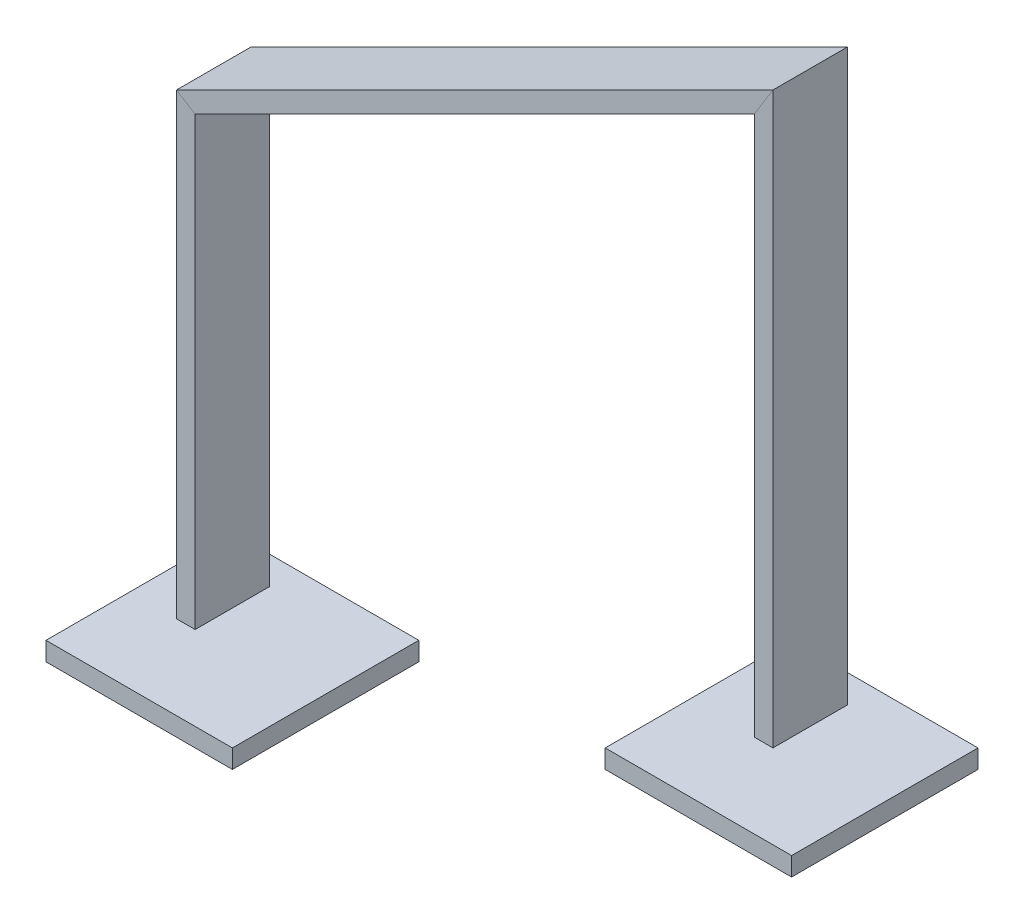
ISO-10303-21;
HEADER;
FILE_DESCRIPTION(('STEP AP214'),'2;1');
FILE_NAME('part.step','',(''),(''),'','','');
FILE_SCHEMA(('AUTOMOTIVE_DESIGN { 1 0 10303 214 1 1 1 1 }'));
ENDSEC;
DATA;
#1=APPLICATION_CONTEXT('core data for automotive mechanical design processes');
#2=APPLICATION_PROTOCOL_DEFINITION('international standard','automotive_design',2000,#1);
#3=PRODUCT_CONTEXT('',#1,'mechanical');
#4=PRODUCT('Part','Part','',(#3));
#5=PRODUCT_RELATED_PRODUCT_CATEGORY('part','',(#4));
#6=PRODUCT_DEFINITION_FORMATION('','',#4);
#7=PRODUCT_DEFINITION_CONTEXT('part definition',#1,'design');
#8=PRODUCT_DEFINITION('design','',#6,#7);
#9=PRODUCT_DEFINITION_SHAPE('','',#8);
#10=(LENGTH_UNIT() NAMED_UNIT(*) SI_UNIT(.MILLI.,.METRE.));
#11=(NAMED_UNIT(*) PLANE_ANGLE_UNIT() SI_UNIT($,.RADIAN.));
#12=(NAMED_UNIT(*) SI_UNIT($,.STERADIAN.) SOLID_ANGLE_UNIT());
#13=UNCERTAINTY_MEASURE_WITH_UNIT(LENGTH_MEASURE(1.E-05),#10,'distance_accuracy_value','');
#14=(GEOMETRIC_REPRESENTATION_CONTEXT(3) GLOBAL_UNCERTAINTY_ASSIGNED_CONTEXT((#13)) GLOBAL_UNIT_ASSIGNED_CONTEXT((#10,
#11,#12)) REPRESENTATION_CONTEXT('',''));
#15=CARTESIAN_POINT('',(0.,0.,0.));
#16=DIRECTION('',(0.,0.,1.));
#17=DIRECTION('',(1.,0.,0.));
#18=AXIS2_PLACEMENT_3D('',#15,#16,#17);
#19=CARTESIAN_POINT('',(400.,125.,0.));
#20=DIRECTION('',(0.,-1.,0.));
#21=DIRECTION('',(0.,0.,1.));
#22=AXIS2_PLACEMENT_3D('',#19,#20,#21);
#23=PLANE('',#22);
#24=DIRECTION('',(0.,0.,-1.));
#25=VECTOR('',#24,1.);
#26=CARTESIAN_POINT('',(350.,125.,0.));
#27=LINE('',#26,#25);
#28=CARTESIAN_POINT('',(350.,125.,20.));
#29=VERTEX_POINT('',#28);
#30=CARTESIAN_POINT('',(350.,125.,-20.));
#31=VERTEX_POINT('',#30);
#32=EDGE_CURVE('E196',#29,#31,#27,.T.);
#33=ORIENTED_EDGE('',*,*,#32,.T.);
#34=DIRECTION('',(1.,0.,0.));
#35=VECTOR('',#34,1.);
#36=CARTESIAN_POINT('',(400.,125.,-20.));
#37=LINE('',#36,#35);
#38=CARTESIAN_POINT('',(360.,125.,-20.));
#39=VERTEX_POINT('',#38);
#40=EDGE_CURVE('E209',#31,#39,#37,.T.);
#41=ORIENTED_EDGE('',*,*,#40,.T.);
#42=DIRECTION('',(0.,0.,1.));
#43=VECTOR('',#42,1.);
#44=CARTESIAN_POINT('',(360.,125.,0.));
#45=LINE('',#44,#43);
#46=CARTESIAN_POINT('',(360.,125.,20.));
#47=VERTEX_POINT('',#46);
#48=EDGE_CURVE('E213',#39,#47,#45,.T.);
#49=ORIENTED_EDGE('',*,*,#48,.T.);
#50=DIRECTION('',(-1.,0.,0.));
#51=VECTOR('',#50,1.);
#52=CARTESIAN_POINT('',(400.,125.,20.));
#53=LINE('',#52,#51);
#54=EDGE_CURVE('E210',#47,#29,#53,.T.);
#55=ORIENTED_EDGE('',*,*,#54,.T.);
#56=EDGE_LOOP('',(#33,#41,#49,#55));
#57=FACE_BOUND('',#56,.T.);
#58=ADVANCED_FACE('F53',(#57),#23,.T.);
#59=CARTESIAN_POINT('',(0.,25.,0.));
#60=DIRECTION('',(0.,1.,0.));
#61=DIRECTION('',(0.,0.,1.));
#62=AXIS2_PLACEMENT_3D('',#59,#60,#61);
#63=PLANE('',#62);
#64=DIRECTION('',(0.,0.,-1.));
#65=VECTOR('',#64,1.);
#66=CARTESIAN_POINT('',(50.,25.,0.));
#67=LINE('',#66,#65);
#68=CARTESIAN_POINT('',(50.,25.,20.));
#69=VERTEX_POINT('',#68);
#70=CARTESIAN_POINT('',(50.,25.,-20.));
#71=VERTEX_POINT('',#70);
#72=EDGE_CURVE('E173',#69,#71,#67,.T.);
#73=ORIENTED_EDGE('',*,*,#72,.F.);
#74=DIRECTION('',(1.,0.,0.));
#75=VECTOR('',#74,1.);
#76=CARTESIAN_POINT('',(0.,25.,20.));
#77=LINE('',#76,#75);
#78=CARTESIAN_POINT('',(40.,25.,20.));
#79=VERTEX_POINT('',#78);
#80=EDGE_CURVE('E57',#79,#69,#77,.T.);
#81=ORIENTED_EDGE('',*,*,#80,.F.);
#82=DIRECTION('',(0.,0.,1.));
#83=VECTOR('',#82,1.);
#84=CARTESIAN_POINT('',(40.,25.,0.));
#85=LINE('',#84,#83);
#86=CARTESIAN_POINT('',(40.,25.,-20.));
#87=VERTEX_POINT('',#86);
#88=EDGE_CURVE('E162',#87,#79,#85,.T.);
#89=ORIENTED_EDGE('',*,*,#88,.F.);
#90=DIRECTION('',(-1.,0.,0.));
#91=VECTOR('',#90,1.);
#92=CARTESIAN_POINT('',(0.,25.,-20.));
#93=LINE('',#92,#91);
#94=EDGE_CURVE('E220',#71,#87,#93,.T.);
#95=ORIENTED_EDGE('',*,*,#94,.F.);
#96=EDGE_LOOP('',(#73,#81,#89,#95));
#97=FACE_BOUND('',#96,.T.);
#98=ADVANCED_FACE('F55',(#97),#63,.F.);
#99=CARTESIAN_POINT('',(350.,432.406871063723,20.));
#100=DIRECTION('',(-1.,0.,0.));
#101=DIRECTION('',(0.,0.,1.));
#102=AXIS2_PLACEMENT_3D('',#99,#100,#101);
#103=PLANE('',#102);
#104=DIRECTION('',(0.,0.,1.));
#105=VECTOR('',#104,1.);
#106=CARTESIAN_POINT('',(350.,414.508497187474,20.0000000000001));
#107=LINE('',#106,#105);
#108=CARTESIAN_POINT('',(350.,414.508497187474,-20.));
#109=VERTEX_POINT('',#108);
#110=CARTESIAN_POINT('',(350.,414.508497187474,20.));
#111=VERTEX_POINT('',#110);
#112=EDGE_CURVE('E140',#109,#111,#107,.T.);
#113=ORIENTED_EDGE('',*,*,#112,.F.);
#114=DIRECTION('',(0.,-1.,0.));
#115=VECTOR('',#114,1.);
#116=CARTESIAN_POINT('',(350.,432.406871063723,-20.));
#117=LINE('',#116,#115);
#118=EDGE_CURVE('E200',#109,#31,#117,.T.);
#119=ORIENTED_EDGE('',*,*,#118,.T.);
#120=ORIENTED_EDGE('',*,*,#32,.F.);
#121=DIRECTION('',(0.,-1.,0.));
#122=VECTOR('',#121,1.);
#123=CARTESIAN_POINT('',(350.,432.406871063723,20.));
#124=LINE('',#123,#122);
#125=EDGE_CURVE('E184',#111,#29,#124,.T.);
#126=ORIENTED_EDGE('',*,*,#125,.F.);
#127=EDGE_LOOP('',(#113,#119,#120,#126));
#128=FACE_BOUND('',#127,.T.);
#129=ADVANCED_FACE('F253',(#128),#103,.T.);
#130=CARTESIAN_POINT('',(350.,432.406871063723,-20.));
#131=DIRECTION('',(0.,0.,-1.));
#132=DIRECTION('',(-1.,0.,0.));
#133=AXIS2_PLACEMENT_3D('',#130,#131,#132);
#134=PLANE('',#133);
#135=DIRECTION('',(-0.525731112119134,-0.85065080835204,0.));
#136=VECTOR('',#135,1.);
#137=CARTESIAN_POINT('',(196.9149534157,166.811688644715,-19.9999999999998));
#138=LINE('',#137,#136);
#139=CARTESIAN_POINT('',(360.,430.688837074973,-20.));
#140=VERTEX_POINT('',#139);
#141=EDGE_CURVE('E169',#140,#109,#138,.T.);
#142=ORIENTED_EDGE('',*,*,#141,.F.);
#143=DIRECTION('',(0.,-1.,0.));
#144=VECTOR('',#143,1.);
#145=CARTESIAN_POINT('',(360.,432.406871063723,-20.));
#146=LINE('',#145,#144);
#147=EDGE_CURVE('E195',#140,#39,#146,.T.);
#148=ORIENTED_EDGE('',*,*,#147,.T.);
#149=ORIENTED_EDGE('',*,*,#40,.F.);
#150=ORIENTED_EDGE('',*,*,#118,.F.);
#151=EDGE_LOOP('',(#142,#148,#149,#150));
#152=FACE_BOUND('',#151,.T.);
#153=ADVANCED_FACE('F256',(#152),#134,.T.);
#154=CARTESIAN_POINT('',(360.,432.406871063723,20.));
#155=DIRECTION('',(1.,0.,0.));
#156=DIRECTION('',(0.,0.,-1.));
#157=AXIS2_PLACEMENT_3D('',#154,#155,#156);
#158=PLANE('',#157);
#159=DIRECTION('',(0.,0.,-1.));
#160=VECTOR('',#159,1.);
#161=CARTESIAN_POINT('',(360.,430.688837074973,20.0000000000001));
#162=LINE('',#161,#160);
#163=CARTESIAN_POINT('',(360.,430.688837074973,20.));
#164=VERTEX_POINT('',#163);
#165=EDGE_CURVE('E174',#164,#140,#162,.T.);
#166=ORIENTED_EDGE('',*,*,#165,.F.);
#167=DIRECTION('',(0.,-1.,0.));
#168=VECTOR('',#167,1.);
#169=CARTESIAN_POINT('',(360.,432.406871063723,20.));
#170=LINE('',#169,#168);
#171=EDGE_CURVE('E191',#164,#47,#170,.T.);
#172=ORIENTED_EDGE('',*,*,#171,.T.);
#173=ORIENTED_EDGE('',*,*,#48,.F.);
#174=ORIENTED_EDGE('',*,*,#147,.F.);
#175=EDGE_LOOP('',(#166,#172,#173,#174));
#176=FACE_BOUND('',#175,.T.);
#177=ADVANCED_FACE('F260',(#176),#158,.T.);
#178=CARTESIAN_POINT('',(350.,432.406871063723,20.));
#179=DIRECTION('',(0.,0.,1.));
#180=DIRECTION('',(1.,0.,0.));
#181=AXIS2_PLACEMENT_3D('',#178,#179,#180);
#182=PLANE('',#181);
#183=DIRECTION('',(0.525731112119134,0.85065080835204,0.));
#184=VECTOR('',#183,1.);
#185=CARTESIAN_POINT('',(196.9149534157,166.811688644715,19.9999999999999));
#186=LINE('',#185,#184);
#187=EDGE_CURVE('E178',#111,#164,#186,.T.);
#188=ORIENTED_EDGE('',*,*,#187,.F.);
#189=ORIENTED_EDGE('',*,*,#125,.T.);
#190=ORIENTED_EDGE('',*,*,#54,.F.);
#191=ORIENTED_EDGE('',*,*,#171,.F.);
#192=EDGE_LOOP('',(#188,#189,#190,#191));
#193=FACE_BOUND('',#192,.T.);
#194=ADVANCED_FACE('F252',(#193),#182,.T.);
#195=CARTESIAN_POINT('',(43.8299068313995,261.423450603173,20.));
#196=DIRECTION('',(0.,0.,1.));
#197=DIRECTION('',(0.,-1.,0.));
#198=AXIS2_PLACEMENT_3D('',#195,#196,#197);
#199=PLANE('',#198);
#200=DIRECTION('',(0.894427190999916,0.447213595499958,0.));
#201=VECTOR('',#200,1.);
#202=CARTESIAN_POINT('',(43.8299068313995,261.423450603173,20.));
#203=LINE('',#202,#201);
#204=CARTESIAN_POINT('',(50.,264.508497187474,20.));
#205=VERTEX_POINT('',#204);
#206=EDGE_CURVE('E129',#205,#111,#203,.T.);
#207=ORIENTED_EDGE('',*,*,#206,.T.);
#208=ORIENTED_EDGE('',*,*,#187,.T.);
#209=DIRECTION('',(0.894427190999916,0.447213595499958,0.));
#210=VECTOR('',#209,1.);
#211=CARTESIAN_POINT('',(39.3577708763999,270.367722513173,20.));
#212=LINE('',#211,#210);
#213=CARTESIAN_POINT('',(40.,270.688837074973,20.));
#214=VERTEX_POINT('',#213);
#215=EDGE_CURVE('E131',#214,#164,#212,.T.);
#216=ORIENTED_EDGE('',*,*,#215,.F.);
#217=DIRECTION('',(-0.85065080835204,0.525731112119134,0.));
#218=VECTOR('',#217,1.);
#219=CARTESIAN_POINT('',(163.819660112501,194.164078649987,20.));
#220=LINE('',#219,#218);
#221=EDGE_CURVE('E126',#205,#214,#220,.T.);
#222=ORIENTED_EDGE('',*,*,#221,.F.);
#223=EDGE_LOOP('',(#207,#208,#216,#222));
#224=FACE_BOUND('',#223,.T.);
#225=ADVANCED_FACE('F127',(#224),#199,.T.);
#226=CARTESIAN_POINT('',(39.3577708763999,270.367722513173,20.));
#227=DIRECTION('',(-0.447213595499958,0.894427190999916,0.));
#228=DIRECTION('',(-0.894427190999916,-0.447213595499958,0.));
#229=AXIS2_PLACEMENT_3D('',#226,#227,#228);
#230=PLANE('',#229);
#231=ORIENTED_EDGE('',*,*,#215,.T.);
#232=ORIENTED_EDGE('',*,*,#165,.T.);
#233=DIRECTION('',(0.894427190999916,0.447213595499958,0.));
#234=VECTOR('',#233,1.);
#235=CARTESIAN_POINT('',(39.3577708763999,270.367722513173,-20.));
#236=LINE('',#235,#234);
#237=CARTESIAN_POINT('',(40.,270.688837074973,-20.));
#238=VERTEX_POINT('',#237);
#239=EDGE_CURVE('E183',#238,#140,#236,.T.);
#240=ORIENTED_EDGE('',*,*,#239,.F.);
#241=DIRECTION('',(0.,0.,-1.));
#242=VECTOR('',#241,1.);
#243=CARTESIAN_POINT('',(40.,270.688837074973,20.));
#244=LINE('',#243,#242);
#245=EDGE_CURVE('E64',#214,#238,#244,.T.);
#246=ORIENTED_EDGE('',*,*,#245,.F.);
#247=EDGE_LOOP('',(#231,#232,#240,#246));
#248=FACE_BOUND('',#247,.T.);
#249=ADVANCED_FACE('F246',(#248),#230,.T.);
#250=CARTESIAN_POINT('',(43.8299068313995,261.423450603173,-20.));
#251=DIRECTION('',(0.,0.,-1.));
#252=DIRECTION('',(0.,1.,0.));
#253=AXIS2_PLACEMENT_3D('',#250,#251,#252);
#254=PLANE('',#253);
#255=ORIENTED_EDGE('',*,*,#239,.T.);
#256=ORIENTED_EDGE('',*,*,#141,.T.);
#257=DIRECTION('',(0.894427190999916,0.447213595499958,0.));
#258=VECTOR('',#257,1.);
#259=CARTESIAN_POINT('',(43.8299068313995,261.423450603173,-20.));
#260=LINE('',#259,#258);
#261=CARTESIAN_POINT('',(50.,264.508497187474,-20.));
#262=VERTEX_POINT('',#261);
#263=EDGE_CURVE('E142',#262,#109,#260,.T.);
#264=ORIENTED_EDGE('',*,*,#263,.F.);
#265=DIRECTION('',(0.85065080835204,-0.525731112119134,0.));
#266=VECTOR('',#265,1.);
#267=CARTESIAN_POINT('',(163.819660112501,194.164078649987,-19.9999999999999));
#268=LINE('',#267,#266);
#269=EDGE_CURVE('E13',#238,#262,#268,.T.);
#270=ORIENTED_EDGE('',*,*,#269,.F.);
#271=EDGE_LOOP('',(#255,#256,#264,#270));
#272=FACE_BOUND('',#271,.T.);
#273=ADVANCED_FACE('F243',(#272),#254,.T.);
#274=CARTESIAN_POINT('',(43.8299068313995,261.423450603173,20.));
#275=DIRECTION('',(0.447213595499958,-0.894427190999916,0.));
#276=DIRECTION('',(0.894427190999916,0.447213595499958,0.));
#277=AXIS2_PLACEMENT_3D('',#274,#275,#276);
#278=PLANE('',#277);
#279=ORIENTED_EDGE('',*,*,#263,.T.);
#280=ORIENTED_EDGE('',*,*,#112,.T.);
#281=ORIENTED_EDGE('',*,*,#206,.F.);
#282=DIRECTION('',(0.,0.,1.));
#283=VECTOR('',#282,1.);
#284=CARTESIAN_POINT('',(50.,264.508497187474,20.));
#285=LINE('',#284,#283);
#286=EDGE_CURVE('E120',#262,#205,#285,.T.);
#287=ORIENTED_EDGE('',*,*,#286,.F.);
#288=EDGE_LOOP('',(#279,#280,#281,#287));
#289=FACE_BOUND('',#288,.T.);
#290=ADVANCED_FACE('F139',(#289),#278,.T.);
#291=CARTESIAN_POINT('',(50.,10.,20.));
#292=DIRECTION('',(0.,0.,1.));
#293=DIRECTION('',(1.,0.,0.));
#294=AXIS2_PLACEMENT_3D('',#291,#292,#293);
#295=PLANE('',#294);
#296=DIRECTION('',(0.,1.,0.));
#297=VECTOR('',#296,1.);
#298=CARTESIAN_POINT('',(50.,10.,20.));
#299=LINE('',#298,#297);
#300=EDGE_CURVE('E149',#69,#205,#299,.T.);
#301=ORIENTED_EDGE('',*,*,#300,.T.);
#302=ORIENTED_EDGE('',*,*,#221,.T.);
#303=DIRECTION('',(0.,1.,0.));
#304=VECTOR('',#303,1.);
#305=CARTESIAN_POINT('',(40.,10.,20.));
#306=LINE('',#305,#304);
#307=EDGE_CURVE('E153',#79,#214,#306,.T.);
#308=ORIENTED_EDGE('',*,*,#307,.F.);
#309=ORIENTED_EDGE('',*,*,#80,.T.);
#310=EDGE_LOOP('',(#301,#302,#308,#309));
#311=FACE_BOUND('',#310,.T.);
#312=ADVANCED_FACE('F155',(#311),#295,.T.);
#313=CARTESIAN_POINT('',(40.,10.,20.));
#314=DIRECTION('',(-1.,0.,0.));
#315=DIRECTION('',(0.,0.,1.));
#316=AXIS2_PLACEMENT_3D('',#313,#314,#315);
#317=PLANE('',#316);
#318=ORIENTED_EDGE('',*,*,#307,.T.);
#319=ORIENTED_EDGE('',*,*,#245,.T.);
#320=DIRECTION('',(0.,1.,0.));
#321=VECTOR('',#320,1.);
#322=CARTESIAN_POINT('',(40.,10.,-20.));
#323=LINE('',#322,#321);
#324=EDGE_CURVE('E160',#87,#238,#323,.T.);
#325=ORIENTED_EDGE('',*,*,#324,.F.);
#326=ORIENTED_EDGE('',*,*,#88,.T.);
#327=EDGE_LOOP('',(#318,#319,#325,#326));
#328=FACE_BOUND('',#327,.T.);
#329=ADVANCED_FACE('F226',(#328),#317,.T.);
#330=CARTESIAN_POINT('',(50.,10.,-20.));
#331=DIRECTION('',(0.,0.,-1.));
#332=DIRECTION('',(-1.,0.,0.));
#333=AXIS2_PLACEMENT_3D('',#330,#331,#332);
#334=PLANE('',#333);
#335=ORIENTED_EDGE('',*,*,#324,.T.);
#336=ORIENTED_EDGE('',*,*,#269,.T.);
#337=DIRECTION('',(0.,1.,0.));
#338=VECTOR('',#337,1.);
#339=CARTESIAN_POINT('',(50.,10.,-20.));
#340=LINE('',#339,#338);
#341=EDGE_CURVE('E151',#71,#262,#340,.T.);
#342=ORIENTED_EDGE('',*,*,#341,.F.);
#343=ORIENTED_EDGE('',*,*,#94,.T.);
#344=EDGE_LOOP('',(#335,#336,#342,#343));
#345=FACE_BOUND('',#344,.T.);
#346=ADVANCED_FACE('F229',(#345),#334,.T.);
#347=CARTESIAN_POINT('',(50.,10.,20.));
#348=DIRECTION('',(1.,0.,0.));
#349=DIRECTION('',(0.,0.,-1.));
#350=AXIS2_PLACEMENT_3D('',#347,#348,#349);
#351=PLANE('',#350);
#352=ORIENTED_EDGE('',*,*,#341,.T.);
#353=ORIENTED_EDGE('',*,*,#286,.T.);
#354=ORIENTED_EDGE('',*,*,#300,.F.);
#355=ORIENTED_EDGE('',*,*,#72,.T.);
#356=EDGE_LOOP('',(#352,#353,#354,#355));
#357=FACE_BOUND('',#356,.T.);
#358=ADVANCED_FACE('F147',(#357),#351,.T.);
#359=CLOSED_SHELL('',(#58,#98,#129,#153,#177,#194,#225,#249,#273,#290,#312,#329,#346,#358));
#360=MANIFOLD_SOLID_BREP('B2',#359);
#361=CARTESIAN_POINT('',(300.,100.,50.));
#362=DIRECTION('',(1.,0.,0.));
#363=DIRECTION('',(0.,0.,-1.));
#364=AXIS2_PLACEMENT_3D('',#361,#362,#363);
#365=PLANE('',#364);
#366=DIRECTION('',(0.,-1.,0.));
#367=VECTOR('',#366,1.);
#368=CARTESIAN_POINT('',(300.,100.,-50.));
#369=LINE('',#368,#367);
#370=CARTESIAN_POINT('',(300.,110.,-50.));
#371=VERTEX_POINT('',#370);
#372=CARTESIAN_POINT('',(300.,100.,-50.));
#373=VERTEX_POINT('',#372);
#374=EDGE_CURVE('E436',#371,#373,#369,.T.);
#375=ORIENTED_EDGE('',*,*,#374,.T.);
#376=DIRECTION('',(0.,0.,-1.));
#377=VECTOR('',#376,1.);
#378=CARTESIAN_POINT('',(300.,100.,50.));
#379=LINE('',#378,#377);
#380=CARTESIAN_POINT('',(300.,100.,50.));
#381=VERTEX_POINT('',#380);
#382=EDGE_CURVE('E51',#381,#373,#379,.T.);
#383=ORIENTED_EDGE('',*,*,#382,.F.);
#384=DIRECTION('',(0.,-1.,0.));
#385=VECTOR('',#384,1.);
#386=CARTESIAN_POINT('',(300.,100.,50.));
#387=LINE('',#386,#385);
#388=CARTESIAN_POINT('',(300.,110.,50.));
#389=VERTEX_POINT('',#388);
#390=EDGE_CURVE('E424',#389,#381,#387,.T.);
#391=ORIENTED_EDGE('',*,*,#390,.F.);
#392=DIRECTION('',(0.,0.,-1.));
#393=VECTOR('',#392,1.);
#394=CARTESIAN_POINT('',(300.,110.,50.));
#395=LINE('',#394,#393);
#396=EDGE_CURVE('E432',#389,#371,#395,.T.);
#397=ORIENTED_EDGE('',*,*,#396,.T.);
#398=EDGE_LOOP('',(#375,#383,#391,#397));
#399=FACE_BOUND('',#398,.T.);
#400=ADVANCED_FACE('F373',(#399),#365,.F.);
#401=CARTESIAN_POINT('',(300.,100.,50.));
#402=DIRECTION('',(0.,1.,0.));
#403=DIRECTION('',(0.,0.,1.));
#404=AXIS2_PLACEMENT_3D('',#401,#402,#403);
#405=PLANE('',#404);
#406=DIRECTION('',(1.,0.,0.));
#407=VECTOR('',#406,1.);
#408=CARTESIAN_POINT('',(300.,100.,-50.));
#409=LINE('',#408,#407);
#410=CARTESIAN_POINT('',(400.,100.,-50.));
#411=VERTEX_POINT('',#410);
#412=EDGE_CURVE('E428',#373,#411,#409,.T.);
#413=ORIENTED_EDGE('',*,*,#412,.T.);
#414=DIRECTION('',(0.,0.,-1.));
#415=VECTOR('',#414,1.);
#416=CARTESIAN_POINT('',(400.,100.,50.));
#417=LINE('',#416,#415);
#418=CARTESIAN_POINT('',(400.,100.,50.));
#419=VERTEX_POINT('',#418);
#420=EDGE_CURVE('E381',#419,#411,#417,.T.);
#421=ORIENTED_EDGE('',*,*,#420,.F.);
#422=DIRECTION('',(1.,0.,0.));
#423=VECTOR('',#422,1.);
#424=CARTESIAN_POINT('',(300.,100.,50.));
#425=LINE('',#424,#423);
#426=EDGE_CURVE('E419',#381,#419,#425,.T.);
#427=ORIENTED_EDGE('',*,*,#426,.F.);
#428=ORIENTED_EDGE('',*,*,#382,.T.);
#429=EDGE_LOOP('',(#413,#421,#427,#428));
#430=FACE_BOUND('',#429,.T.);
#431=ADVANCED_FACE('F427',(#430),#405,.F.);
#432=CARTESIAN_POINT('',(400.,100.,50.));
#433=DIRECTION('',(-1.,0.,0.));
#434=DIRECTION('',(0.,0.,1.));
#435=AXIS2_PLACEMENT_3D('',#432,#433,#434);
#436=PLANE('',#435);
#437=DIRECTION('',(0.,1.,0.));
#438=VECTOR('',#437,1.);
#439=CARTESIAN_POINT('',(400.,100.,-50.));
#440=LINE('',#439,#438);
#441=CARTESIAN_POINT('',(400.,110.,-50.));
#442=VERTEX_POINT('',#441);
#443=EDGE_CURVE('E406',#411,#442,#440,.T.);
#444=ORIENTED_EDGE('',*,*,#443,.T.);
#445=DIRECTION('',(0.,0.,-1.));
#446=VECTOR('',#445,1.);
#447=CARTESIAN_POINT('',(400.,110.,50.));
#448=LINE('',#447,#446);
#449=CARTESIAN_POINT('',(400.,110.,50.));
#450=VERTEX_POINT('',#449);
#451=EDGE_CURVE('E429',#450,#442,#448,.T.);
#452=ORIENTED_EDGE('',*,*,#451,.F.);
#453=DIRECTION('',(0.,1.,0.));
#454=VECTOR('',#453,1.);
#455=CARTESIAN_POINT('',(400.,100.,50.));
#456=LINE('',#455,#454);
#457=EDGE_CURVE('E422',#419,#450,#456,.T.);
#458=ORIENTED_EDGE('',*,*,#457,.F.);
#459=ORIENTED_EDGE('',*,*,#420,.T.);
#460=EDGE_LOOP('',(#444,#452,#458,#459));
#461=FACE_BOUND('',#460,.T.);
#462=ADVANCED_FACE('F430',(#461),#436,.F.);
#463=CARTESIAN_POINT('',(300.,110.,50.));
#464=DIRECTION('',(0.,-1.,0.));
#465=DIRECTION('',(0.,0.,-1.));
#466=AXIS2_PLACEMENT_3D('',#463,#464,#465);
#467=PLANE('',#466);
#468=DIRECTION('',(-1.,0.,0.));
#469=VECTOR('',#468,1.);
#470=CARTESIAN_POINT('',(300.,110.,-50.));
#471=LINE('',#470,#469);
#472=EDGE_CURVE('E412',#442,#371,#471,.T.);
#473=ORIENTED_EDGE('',*,*,#472,.T.);
#474=ORIENTED_EDGE('',*,*,#396,.F.);
#475=DIRECTION('',(-1.,0.,0.));
#476=VECTOR('',#475,1.);
#477=CARTESIAN_POINT('',(300.,110.,50.));
#478=LINE('',#477,#476);
#479=EDGE_CURVE('E389',#450,#389,#478,.T.);
#480=ORIENTED_EDGE('',*,*,#479,.F.);
#481=ORIENTED_EDGE('',*,*,#451,.T.);
#482=EDGE_LOOP('',(#473,#474,#480,#481));
#483=FACE_BOUND('',#482,.T.);
#484=ADVANCED_FACE('F443',(#483),#467,.F.);
#485=CARTESIAN_POINT('',(0.,0.,50.));
#486=DIRECTION('',(0.,0.,-1.));
#487=DIRECTION('',(-1.,0.,0.));
#488=AXIS2_PLACEMENT_3D('',#485,#486,#487);
#489=PLANE('',#488);
#490=ORIENTED_EDGE('',*,*,#390,.T.);
#491=ORIENTED_EDGE('',*,*,#426,.T.);
#492=ORIENTED_EDGE('',*,*,#457,.T.);
#493=ORIENTED_EDGE('',*,*,#479,.T.);
#494=EDGE_LOOP('',(#490,#491,#492,#493));
#495=FACE_BOUND('',#494,.T.);
#496=ADVANCED_FACE('F420',(#495),#489,.F.);
#497=CARTESIAN_POINT('',(0.,0.,-50.));
#498=DIRECTION('',(0.,0.,-1.));
#499=DIRECTION('',(-1.,0.,0.));
#500=AXIS2_PLACEMENT_3D('',#497,#498,#499);
#501=PLANE('',#500);
#502=ORIENTED_EDGE('',*,*,#374,.F.);
#503=ORIENTED_EDGE('',*,*,#472,.F.);
#504=ORIENTED_EDGE('',*,*,#443,.F.);
#505=ORIENTED_EDGE('',*,*,#412,.F.);
#506=EDGE_LOOP('',(#502,#503,#504,#505));
#507=FACE_BOUND('',#506,.T.);
#508=ADVANCED_FACE('F446',(#507),#501,.T.);
#509=CLOSED_SHELL('',(#400,#431,#462,#484,#496,#508));
#510=MANIFOLD_SOLID_BREP('B7',#509);
#511=CARTESIAN_POINT('',(0.,10.,50.));
#512=DIRECTION('',(1.,0.,0.));
#513=DIRECTION('',(0.,0.,-1.));
#514=AXIS2_PLACEMENT_3D('',#511,#512,#513);
#515=PLANE('',#514);
#516=DIRECTION('',(0.,0.,1.));
#517=VECTOR('',#516,1.);
#518=CARTESIAN_POINT('',(0.,0.,50.));
#519=LINE('',#518,#517);
#520=CARTESIAN_POINT('',(0.,0.,-50.));
#521=VERTEX_POINT('',#520);
#522=CARTESIAN_POINT('',(0.,0.,50.));
#523=VERTEX_POINT('',#522);
#524=EDGE_CURVE('E559',#521,#523,#519,.T.);
#525=ORIENTED_EDGE('',*,*,#524,.T.);
#526=DIRECTION('',(0.,-1.,0.));
#527=VECTOR('',#526,1.);
#528=CARTESIAN_POINT('',(0.,10.,50.));
#529=LINE('',#528,#527);
#530=CARTESIAN_POINT('',(0.,10.,50.));
#531=VERTEX_POINT('',#530);
#532=EDGE_CURVE('E371',#531,#523,#529,.T.);
#533=ORIENTED_EDGE('',*,*,#532,.F.);
#534=DIRECTION('',(0.,0.,1.));
#535=VECTOR('',#534,1.);
#536=CARTESIAN_POINT('',(0.,10.,50.));
#537=LINE('',#536,#535);
#538=CARTESIAN_POINT('',(0.,10.,-50.));
#539=VERTEX_POINT('',#538);
#540=EDGE_CURVE('E547',#539,#531,#537,.T.);
#541=ORIENTED_EDGE('',*,*,#540,.F.);
#542=DIRECTION('',(0.,-1.,0.));
#543=VECTOR('',#542,1.);
#544=CARTESIAN_POINT('',(0.,10.,-50.));
#545=LINE('',#544,#543);
#546=EDGE_CURVE('E555',#539,#521,#545,.T.);
#547=ORIENTED_EDGE('',*,*,#546,.T.);
#548=EDGE_LOOP('',(#525,#533,#541,#547));
#549=FACE_BOUND('',#548,.T.);
#550=ADVANCED_FACE('F496',(#549),#515,.F.);
#551=CARTESIAN_POINT('',(0.,10.,50.));
#552=DIRECTION('',(0.,0.,-1.));
#553=DIRECTION('',(-1.,0.,0.));
#554=AXIS2_PLACEMENT_3D('',#551,#552,#553);
#555=PLANE('',#554);
#556=DIRECTION('',(1.,0.,0.));
#557=VECTOR('',#556,1.);
#558=CARTESIAN_POINT('',(0.,0.,50.));
#559=LINE('',#558,#557);
#560=CARTESIAN_POINT('',(100.,0.,50.));
#561=VERTEX_POINT('',#560);
#562=EDGE_CURVE('E551',#523,#561,#559,.T.);
#563=ORIENTED_EDGE('',*,*,#562,.T.);
#564=DIRECTION('',(0.,-1.,0.));
#565=VECTOR('',#564,1.);
#566=CARTESIAN_POINT('',(100.,10.,50.));
#567=LINE('',#566,#565);
#568=CARTESIAN_POINT('',(100.,10.,50.));
#569=VERTEX_POINT('',#568);
#570=EDGE_CURVE('E504',#569,#561,#567,.T.);
#571=ORIENTED_EDGE('',*,*,#570,.F.);
#572=DIRECTION('',(1.,0.,0.));
#573=VECTOR('',#572,1.);
#574=CARTESIAN_POINT('',(0.,10.,50.));
#575=LINE('',#574,#573);
#576=EDGE_CURVE('E542',#531,#569,#575,.T.);
#577=ORIENTED_EDGE('',*,*,#576,.F.);
#578=ORIENTED_EDGE('',*,*,#532,.T.);
#579=EDGE_LOOP('',(#563,#571,#577,#578));
#580=FACE_BOUND('',#579,.T.);
#581=ADVANCED_FACE('F550',(#580),#555,.F.);
#582=CARTESIAN_POINT('',(100.,10.,50.));
#583=DIRECTION('',(-1.,0.,0.));
#584=DIRECTION('',(0.,0.,1.));
#585=AXIS2_PLACEMENT_3D('',#582,#583,#584);
#586=PLANE('',#585);
#587=DIRECTION('',(0.,0.,-1.));
#588=VECTOR('',#587,1.);
#589=CARTESIAN_POINT('',(100.,0.,50.));
#590=LINE('',#589,#588);
#591=CARTESIAN_POINT('',(100.,0.,-50.));
#592=VERTEX_POINT('',#591);
#593=EDGE_CURVE('E529',#561,#592,#590,.T.);
#594=ORIENTED_EDGE('',*,*,#593,.T.);
#595=DIRECTION('',(0.,-1.,0.));
#596=VECTOR('',#595,1.);
#597=CARTESIAN_POINT('',(100.,10.,-50.));
#598=LINE('',#597,#596);
#599=CARTESIAN_POINT('',(100.,10.,-50.));
#600=VERTEX_POINT('',#599);
#601=EDGE_CURVE('E552',#600,#592,#598,.T.);
#602=ORIENTED_EDGE('',*,*,#601,.F.);
#603=DIRECTION('',(0.,0.,-1.));
#604=VECTOR('',#603,1.);
#605=CARTESIAN_POINT('',(100.,10.,50.));
#606=LINE('',#605,#604);
#607=EDGE_CURVE('E545',#569,#600,#606,.T.);
#608=ORIENTED_EDGE('',*,*,#607,.F.);
#609=ORIENTED_EDGE('',*,*,#570,.T.);
#610=EDGE_LOOP('',(#594,#602,#608,#609));
#611=FACE_BOUND('',#610,.T.);
#612=ADVANCED_FACE('F553',(#611),#586,.F.);
#613=CARTESIAN_POINT('',(0.,10.,-50.));
#614=DIRECTION('',(0.,0.,1.));
#615=DIRECTION('',(1.,0.,0.));
#616=AXIS2_PLACEMENT_3D('',#613,#614,#615);
#617=PLANE('',#616);
#618=DIRECTION('',(-1.,0.,0.));
#619=VECTOR('',#618,1.);
#620=CARTESIAN_POINT('',(0.,0.,-50.));
#621=LINE('',#620,#619);
#622=EDGE_CURVE('E535',#592,#521,#621,.T.);
#623=ORIENTED_EDGE('',*,*,#622,.T.);
#624=ORIENTED_EDGE('',*,*,#546,.F.);
#625=DIRECTION('',(-1.,0.,0.));
#626=VECTOR('',#625,1.);
#627=CARTESIAN_POINT('',(0.,10.,-50.));
#628=LINE('',#627,#626);
#629=EDGE_CURVE('E512',#600,#539,#628,.T.);
#630=ORIENTED_EDGE('',*,*,#629,.F.);
#631=ORIENTED_EDGE('',*,*,#601,.T.);
#632=EDGE_LOOP('',(#623,#624,#630,#631));
#633=FACE_BOUND('',#632,.T.);
#634=ADVANCED_FACE('F566',(#633),#617,.F.);
#635=CARTESIAN_POINT('',(0.,10.,0.));
#636=DIRECTION('',(0.,-1.,0.));
#637=DIRECTION('',(0.,0.,-1.));
#638=AXIS2_PLACEMENT_3D('',#635,#636,#637);
#639=PLANE('',#638);
#640=ORIENTED_EDGE('',*,*,#540,.T.);
#641=ORIENTED_EDGE('',*,*,#576,.T.);
#642=ORIENTED_EDGE('',*,*,#607,.T.);
#643=ORIENTED_EDGE('',*,*,#629,.T.);
#644=EDGE_LOOP('',(#640,#641,#642,#643));
#645=FACE_BOUND('',#644,.T.);
#646=ADVANCED_FACE('F543',(#645),#639,.F.);
#647=CARTESIAN_POINT('',(0.,0.,0.));
#648=DIRECTION('',(0.,-1.,0.));
#649=DIRECTION('',(0.,0.,-1.));
#650=AXIS2_PLACEMENT_3D('',#647,#648,#649);
#651=PLANE('',#650);
#652=ORIENTED_EDGE('',*,*,#524,.F.);
#653=ORIENTED_EDGE('',*,*,#622,.F.);
#654=ORIENTED_EDGE('',*,*,#593,.F.);
#655=ORIENTED_EDGE('',*,*,#562,.F.);
#656=EDGE_LOOP('',(#652,#653,#654,#655));
#657=FACE_BOUND('',#656,.T.);
#658=ADVANCED_FACE('F569',(#657),#651,.T.);
#659=CLOSED_SHELL('',(#550,#581,#612,#634,#646,#658));
#660=MANIFOLD_SOLID_BREP('B45',#659);
#661=ADVANCED_BREP_SHAPE_REPRESENTATION('',(#18,#360,#510,#660),#14);
#662=SHAPE_DEFINITION_REPRESENTATION(#9,#661);
ENDSEC;
END-ISO-10303-21;
